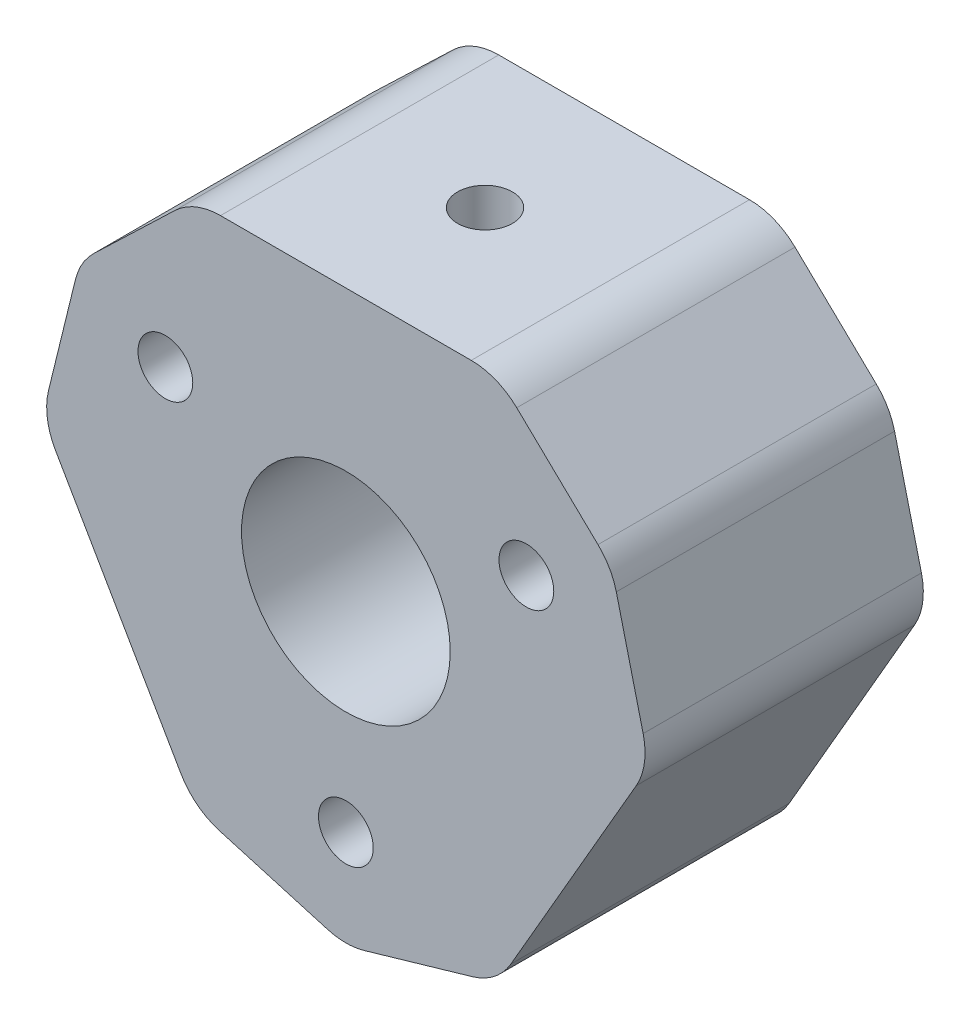
ISO-10303-21;
HEADER;
FILE_DESCRIPTION(('STEP AP214'),'2;1');
FILE_NAME('part.step','',(''),(''),'','','');
FILE_SCHEMA(('AUTOMOTIVE_DESIGN { 1 0 10303 214 1 1 1 1 }'));
ENDSEC;
DATA;
#1=APPLICATION_CONTEXT('core data for automotive mechanical design processes');
#2=APPLICATION_PROTOCOL_DEFINITION('international standard','automotive_design',2000,#1);
#3=PRODUCT_CONTEXT('',#1,'mechanical');
#4=PRODUCT('Part','Part','',(#3));
#5=PRODUCT_RELATED_PRODUCT_CATEGORY('part','',(#4));
#6=PRODUCT_DEFINITION_FORMATION('','',#4);
#7=PRODUCT_DEFINITION_CONTEXT('part definition',#1,'design');
#8=PRODUCT_DEFINITION('design','',#6,#7);
#9=PRODUCT_DEFINITION_SHAPE('','',#8);
#10=(LENGTH_UNIT() NAMED_UNIT(*) SI_UNIT(.MILLI.,.METRE.));
#11=(NAMED_UNIT(*) PLANE_ANGLE_UNIT() SI_UNIT($,.RADIAN.));
#12=(NAMED_UNIT(*) SI_UNIT($,.STERADIAN.) SOLID_ANGLE_UNIT());
#13=UNCERTAINTY_MEASURE_WITH_UNIT(LENGTH_MEASURE(1.E-05),#10,'distance_accuracy_value','');
#14=(GEOMETRIC_REPRESENTATION_CONTEXT(3) GLOBAL_UNCERTAINTY_ASSIGNED_CONTEXT((#13)) GLOBAL_UNIT_ASSIGNED_CONTEXT((#10,
#11,#12)) REPRESENTATION_CONTEXT('',''));
#15=CARTESIAN_POINT('',(0.,0.,0.));
#16=DIRECTION('',(0.,0.,1.));
#17=DIRECTION('',(1.,0.,0.));
#18=AXIS2_PLACEMENT_3D('',#15,#16,#17);
#19=CARTESIAN_POINT('',(0.,-10.888495471054,12.7));
#20=DIRECTION('',(0.,0.,1.));
#21=DIRECTION('',(1.,0.,0.));
#22=AXIS2_PLACEMENT_3D('',#19,#20,#21);
#23=PLANE('',#22);
#24=CARTESIAN_POINT('',(8.23806665349945,4.75625000000004,12.7));
#25=DIRECTION('',(0.,0.,1.));
#26=DIRECTION('',(1.,0.,0.));
#27=AXIS2_PLACEMENT_3D('',#24,#25,#26);
#28=CIRCLE('',#27,1.25);
#29=CARTESIAN_POINT('',(9.48806665349945,4.75625000000004,12.7));
#30=VERTEX_POINT('',#29);
#31=EDGE_CURVE('E394',#30,#30,#28,.T.);
#32=ORIENTED_EDGE('',*,*,#31,.F.);
#33=EDGE_LOOP('',(#32));
#34=FACE_BOUND('',#33,.T.);
#35=CARTESIAN_POINT('',(0.,0.,12.7));
#36=DIRECTION('',(0.,0.,1.));
#37=DIRECTION('',(1.,0.,0.));
#38=AXIS2_PLACEMENT_3D('',#35,#36,#37);
#39=CIRCLE('',#38,4.7625);
#40=CARTESIAN_POINT('',(4.7625,0.,12.7));
#41=VERTEX_POINT('',#40);
#42=EDGE_CURVE('E210',#41,#41,#39,.T.);
#43=ORIENTED_EDGE('',*,*,#42,.F.);
#44=EDGE_LOOP('',(#43));
#45=FACE_BOUND('',#44,.T.);
#46=CARTESIAN_POINT('',(0.,-10.888495471054,12.7));
#47=DIRECTION('',(0.,0.,1.));
#48=DIRECTION('',(1.,0.,0.));
#49=AXIS2_PLACEMENT_3D('',#46,#47,#48);
#50=CIRCLE('',#49,3.);
#51=CARTESIAN_POINT('',(-0.836847118322298,-13.7694131895173,12.7));
#52=VERTEX_POINT('',#51);
#53=CARTESIAN_POINT('',(0.836847118322313,-13.7694131895173,12.7));
#54=VERTEX_POINT('',#53);
#55=EDGE_CURVE('E241',#52,#54,#50,.T.);
#56=ORIENTED_EDGE('',*,*,#55,.T.);
#57=DIRECTION('',(0.960305906154426,0.278949039440768,0.));
#58=VECTOR('',#57,1.);
#59=CARTESIAN_POINT('',(0.836847118322313,-13.7694131895173,12.7));
#60=LINE('',#59,#58);
#61=CARTESIAN_POINT('',(5.77000843492431,-12.3364316761752,12.7));
#62=VERTEX_POINT('',#61);
#63=EDGE_CURVE('E139',#54,#62,#60,.T.);
#64=ORIENTED_EDGE('',*,*,#63,.T.);
#65=CARTESIAN_POINT('',(4.93316131660201,-9.45551395771196,12.7));
#66=DIRECTION('',(0.,0.,1.));
#67=DIRECTION('',(1.,0.,0.));
#68=AXIS2_PLACEMENT_3D('',#65,#66,#67);
#69=CIRCLE('',#68,3.);
#70=CARTESIAN_POINT('',(7.53123752795532,-10.955513957712,12.7));
#71=VERTEX_POINT('',#70);
#72=EDGE_CURVE('E286',#62,#71,#69,.T.);
#73=ORIENTED_EDGE('',*,*,#72,.T.);
#74=DIRECTION('',(0.499999999999999,0.866025403784439,0.));
#75=VECTOR('',#74,1.);
#76=CARTESIAN_POINT('',(7.53123752795532,-10.955513957712,12.7));
#77=LINE('',#76,#75);
#78=CARTESIAN_POINT('',(13.2533721628712,-1.04448604228802,12.7));
#79=VERTEX_POINT('',#78);
#80=EDGE_CURVE('E305',#71,#79,#77,.T.);
#81=ORIENTED_EDGE('',*,*,#80,.T.);
#82=CARTESIAN_POINT('',(10.6552959515179,0.455513957711976,12.7));
#83=DIRECTION('',(0.,0.,1.));
#84=DIRECTION('',(1.,0.,0.));
#85=AXIS2_PLACEMENT_3D('',#82,#83,#84);
#86=CIRCLE('',#85,3.);
#87=CARTESIAN_POINT('',(13.568667441081,1.17124195339269,12.7));
#88=VERTEX_POINT('',#87);
#89=EDGE_CURVE('E302',#79,#88,#86,.T.);
#90=ORIENTED_EDGE('',*,*,#89,.T.);
#91=DIRECTION('',(-0.238575998560237,0.971123829854353,0.));
#92=VECTOR('',#91,1.);
#93=CARTESIAN_POINT('',(12.3430851764877,6.15997573120774,12.7));
#94=LINE('',#93,#92);
#95=CARTESIAN_POINT('',(12.3430851764877,6.15997573120774,12.7));
#96=VERTEX_POINT('',#95);
#97=EDGE_CURVE('E304',#88,#96,#94,.T.);
#98=ORIENTED_EDGE('',*,*,#97,.T.);
#99=CARTESIAN_POINT('',(9.42971368692461,5.44424773552703,12.7));
#100=DIRECTION('',(0.,0.,1.));
#101=DIRECTION('',(-1.,0.,0.));
#102=AXIS2_PLACEMENT_3D('',#99,#100,#101);
#103=CIRCLE('',#102,3.);
#104=CARTESIAN_POINT('',(11.5062380581653,7.60943745830959,12.7));
#105=VERTEX_POINT('',#104);
#106=EDGE_CURVE('E307',#96,#105,#103,.T.);
#107=ORIENTED_EDGE('',*,*,#106,.T.);
#108=DIRECTION('',(-0.721729907594188,0.692174790413581,0.));
#109=VECTOR('',#108,1.);
#110=CARTESIAN_POINT('',(7.79865900615664,11.1651897227826,12.7));
#111=LINE('',#110,#109);
#112=CARTESIAN_POINT('',(7.79865900615664,11.1651897227826,12.7));
#113=VERTEX_POINT('',#112);
#114=EDGE_CURVE('E313',#105,#113,#111,.T.);
#115=ORIENTED_EDGE('',*,*,#114,.T.);
#116=CARTESIAN_POINT('',(5.7221346349159,9.,12.7));
#117=DIRECTION('',(0.,0.,1.));
#118=DIRECTION('',(1.,0.,0.));
#119=AXIS2_PLACEMENT_3D('',#116,#117,#118);
#120=CIRCLE('',#119,3.);
#121=CARTESIAN_POINT('',(5.7221346349159,12.,12.7));
#122=VERTEX_POINT('',#121);
#123=EDGE_CURVE('E315',#113,#122,#120,.T.);
#124=ORIENTED_EDGE('',*,*,#123,.T.);
#125=DIRECTION('',(-1.,0.,0.));
#126=VECTOR('',#125,1.);
#127=CARTESIAN_POINT('',(5.7221346349159,12.,12.7));
#128=LINE('',#127,#126);
#129=CARTESIAN_POINT('',(-5.7221346349159,12.,12.7));
#130=VERTEX_POINT('',#129);
#131=EDGE_CURVE('E317',#122,#130,#128,.T.);
#132=ORIENTED_EDGE('',*,*,#131,.T.);
#133=CARTESIAN_POINT('',(-5.7221346349159,9.,12.7));
#134=DIRECTION('',(0.,0.,1.));
#135=DIRECTION('',(1.,0.,0.));
#136=AXIS2_PLACEMENT_3D('',#133,#134,#135);
#137=CIRCLE('',#136,3.);
#138=CARTESIAN_POINT('',(-7.79865900615666,11.1651897227825,12.7));
#139=VERTEX_POINT('',#138);
#140=EDGE_CURVE('E319',#130,#139,#137,.T.);
#141=ORIENTED_EDGE('',*,*,#140,.T.);
#142=DIRECTION('',(-0.721729907594183,-0.692174790413586,0.));
#143=VECTOR('',#142,1.);
#144=CARTESIAN_POINT('',(-7.79865900615666,11.1651897227825,12.7));
#145=LINE('',#144,#143);
#146=CARTESIAN_POINT('',(-11.5062380581653,7.60943745830954,12.7));
#147=VERTEX_POINT('',#146);
#148=EDGE_CURVE('E321',#139,#147,#145,.T.);
#149=ORIENTED_EDGE('',*,*,#148,.T.);
#150=CARTESIAN_POINT('',(-9.42971368692457,5.44424773552699,12.7));
#151=DIRECTION('',(0.,0.,1.));
#152=DIRECTION('',(1.,0.,0.));
#153=AXIS2_PLACEMENT_3D('',#150,#151,#152);
#154=CIRCLE('',#153,3.);
#155=CARTESIAN_POINT('',(-12.3430851764876,6.15997573120772,12.7));
#156=VERTEX_POINT('',#155);
#157=EDGE_CURVE('E323',#147,#156,#154,.T.);
#158=ORIENTED_EDGE('',*,*,#157,.T.);
#159=DIRECTION('',(-0.238575998560243,-0.971123829854351,0.));
#160=VECTOR('',#159,1.);
#161=CARTESIAN_POINT('',(-12.3430851764876,6.15997573120772,12.7));
#162=LINE('',#161,#160);
#163=CARTESIAN_POINT('',(-13.5686674410809,1.17124195339268,12.7));
#164=VERTEX_POINT('',#163);
#165=EDGE_CURVE('E325',#156,#164,#162,.T.);
#166=ORIENTED_EDGE('',*,*,#165,.T.);
#167=CARTESIAN_POINT('',(-10.6552959515179,0.455513957711953,12.7));
#168=DIRECTION('',(0.,0.,1.));
#169=DIRECTION('',(-1.,0.,0.));
#170=AXIS2_PLACEMENT_3D('',#167,#168,#169);
#171=CIRCLE('',#170,3.);
#172=CARTESIAN_POINT('',(-13.2533721628712,-1.04448604228805,12.7));
#173=VERTEX_POINT('',#172);
#174=EDGE_CURVE('E188',#164,#173,#171,.T.);
#175=ORIENTED_EDGE('',*,*,#174,.T.);
#176=DIRECTION('',(0.5,-0.866025403784438,0.));
#177=VECTOR('',#176,1.);
#178=CARTESIAN_POINT('',(-13.2533721628712,-1.04448604228805,12.7));
#179=LINE('',#178,#177);
#180=CARTESIAN_POINT('',(-7.53123752795531,-10.955513957712,12.7));
#181=VERTEX_POINT('',#180);
#182=EDGE_CURVE('E182',#173,#181,#179,.T.);
#183=ORIENTED_EDGE('',*,*,#182,.T.);
#184=CARTESIAN_POINT('',(-4.93316131660199,-9.45551395771196,12.7));
#185=DIRECTION('',(0.,0.,1.));
#186=DIRECTION('',(1.,0.,0.));
#187=AXIS2_PLACEMENT_3D('',#184,#185,#186);
#188=CIRCLE('',#187,3.);
#189=CARTESIAN_POINT('',(-5.7700084349243,-12.3364316761752,12.7));
#190=VERTEX_POINT('',#189);
#191=EDGE_CURVE('E186',#181,#190,#188,.T.);
#192=ORIENTED_EDGE('',*,*,#191,.T.);
#193=DIRECTION('',(0.960305906154426,-0.278949039440768,0.));
#194=VECTOR('',#193,1.);
#195=CARTESIAN_POINT('',(-5.7700084349243,-12.3364316761752,12.7));
#196=LINE('',#195,#194);
#197=EDGE_CURVE('E66',#190,#52,#196,.T.);
#198=ORIENTED_EDGE('',*,*,#197,.T.);
#199=EDGE_LOOP('',(#56,#64,#73,#81,#90,#98,#107,#115,#124,#132,#141,#149,#158,#166,#175,#183,
#192,#198));
#200=FACE_BOUND('',#199,.T.);
#201=CARTESIAN_POINT('',(-8.23806665349949,4.75624999999998,12.7));
#202=DIRECTION('',(0.,0.,1.));
#203=DIRECTION('',(1.,0.,0.));
#204=AXIS2_PLACEMENT_3D('',#201,#202,#203);
#205=CIRCLE('',#204,1.25);
#206=CARTESIAN_POINT('',(-6.98806665349949,4.75624999999998,12.7));
#207=VERTEX_POINT('',#206);
#208=EDGE_CURVE('E400',#207,#207,#205,.T.);
#209=ORIENTED_EDGE('',*,*,#208,.F.);
#210=EDGE_LOOP('',(#209));
#211=FACE_BOUND('',#210,.T.);
#212=CARTESIAN_POINT('',(0.,-9.5125,12.7));
#213=DIRECTION('',(0.,0.,1.));
#214=DIRECTION('',(1.,0.,0.));
#215=AXIS2_PLACEMENT_3D('',#212,#213,#214);
#216=CIRCLE('',#215,1.25);
#217=CARTESIAN_POINT('',(1.25,-9.5125,12.7));
#218=VERTEX_POINT('',#217);
#219=EDGE_CURVE('E388',#218,#218,#216,.T.);
#220=ORIENTED_EDGE('',*,*,#219,.F.);
#221=EDGE_LOOP('',(#220));
#222=FACE_BOUND('',#221,.T.);
#223=ADVANCED_FACE('F49',(#34,#45,#200,#211,#222),#23,.T.);
#224=CARTESIAN_POINT('',(0.,-10.888495471054,0.));
#225=DIRECTION('',(0.,0.,1.));
#226=DIRECTION('',(1.,0.,0.));
#227=AXIS2_PLACEMENT_3D('',#224,#225,#226);
#228=PLANE('',#227);
#229=CARTESIAN_POINT('',(0.,-10.888495471054,0.));
#230=DIRECTION('',(0.,0.,1.));
#231=DIRECTION('',(1.,0.,0.));
#232=AXIS2_PLACEMENT_3D('',#229,#230,#231);
#233=CIRCLE('',#232,3.);
#234=CARTESIAN_POINT('',(-0.836847118322298,-13.7694131895173,0.));
#235=VERTEX_POINT('',#234);
#236=CARTESIAN_POINT('',(0.836847118322313,-13.7694131895173,0.));
#237=VERTEX_POINT('',#236);
#238=EDGE_CURVE('E206',#235,#237,#233,.T.);
#239=ORIENTED_EDGE('',*,*,#238,.F.);
#240=DIRECTION('',(0.960305906154426,-0.278949039440768,0.));
#241=VECTOR('',#240,1.);
#242=CARTESIAN_POINT('',(-5.7700084349243,-12.3364316761752,0.));
#243=LINE('',#242,#241);
#244=CARTESIAN_POINT('',(-5.7700084349243,-12.3364316761752,0.));
#245=VERTEX_POINT('',#244);
#246=EDGE_CURVE('E131',#245,#235,#243,.T.);
#247=ORIENTED_EDGE('',*,*,#246,.F.);
#248=CARTESIAN_POINT('',(-4.93316131660199,-9.45551395771196,0.));
#249=DIRECTION('',(0.,0.,1.));
#250=DIRECTION('',(1.,0.,0.));
#251=AXIS2_PLACEMENT_3D('',#248,#249,#250);
#252=CIRCLE('',#251,3.);
#253=CARTESIAN_POINT('',(-7.53123752795531,-10.955513957712,0.));
#254=VERTEX_POINT('',#253);
#255=EDGE_CURVE('E125',#254,#245,#252,.T.);
#256=ORIENTED_EDGE('',*,*,#255,.F.);
#257=DIRECTION('',(0.5,-0.866025403784438,0.));
#258=VECTOR('',#257,1.);
#259=CARTESIAN_POINT('',(-13.2533721628712,-1.04448604228805,0.));
#260=LINE('',#259,#258);
#261=CARTESIAN_POINT('',(-13.2533721628712,-1.04448604228805,0.));
#262=VERTEX_POINT('',#261);
#263=EDGE_CURVE('E196',#262,#254,#260,.T.);
#264=ORIENTED_EDGE('',*,*,#263,.F.);
#265=CARTESIAN_POINT('',(-10.6552959515179,0.455513957711953,0.));
#266=DIRECTION('',(0.,0.,1.));
#267=DIRECTION('',(-1.,0.,0.));
#268=AXIS2_PLACEMENT_3D('',#265,#266,#267);
#269=CIRCLE('',#268,3.);
#270=CARTESIAN_POINT('',(-13.5686674410809,1.17124195339268,0.));
#271=VERTEX_POINT('',#270);
#272=EDGE_CURVE('E236',#271,#262,#269,.T.);
#273=ORIENTED_EDGE('',*,*,#272,.F.);
#274=DIRECTION('',(-0.238575998560243,-0.971123829854351,0.));
#275=VECTOR('',#274,1.);
#276=CARTESIAN_POINT('',(-12.3430851764876,6.15997573120772,0.));
#277=LINE('',#276,#275);
#278=CARTESIAN_POINT('',(-12.3430851764876,6.15997573120772,0.));
#279=VERTEX_POINT('',#278);
#280=EDGE_CURVE('E234',#279,#271,#277,.T.);
#281=ORIENTED_EDGE('',*,*,#280,.F.);
#282=CARTESIAN_POINT('',(-9.42971368692457,5.44424773552699,0.));
#283=DIRECTION('',(0.,0.,1.));
#284=DIRECTION('',(1.,0.,0.));
#285=AXIS2_PLACEMENT_3D('',#282,#283,#284);
#286=CIRCLE('',#285,3.);
#287=CARTESIAN_POINT('',(-11.5062380581653,7.60943745830954,0.));
#288=VERTEX_POINT('',#287);
#289=EDGE_CURVE('E232',#288,#279,#286,.T.);
#290=ORIENTED_EDGE('',*,*,#289,.F.);
#291=DIRECTION('',(-0.721729907594183,-0.692174790413586,0.));
#292=VECTOR('',#291,1.);
#293=CARTESIAN_POINT('',(-7.79865900615666,11.1651897227825,0.));
#294=LINE('',#293,#292);
#295=CARTESIAN_POINT('',(-7.79865900615666,11.1651897227825,0.));
#296=VERTEX_POINT('',#295);
#297=EDGE_CURVE('E230',#296,#288,#294,.T.);
#298=ORIENTED_EDGE('',*,*,#297,.F.);
#299=CARTESIAN_POINT('',(-5.7221346349159,9.,0.));
#300=DIRECTION('',(0.,0.,1.));
#301=DIRECTION('',(1.,0.,0.));
#302=AXIS2_PLACEMENT_3D('',#299,#300,#301);
#303=CIRCLE('',#302,3.);
#304=CARTESIAN_POINT('',(-5.7221346349159,12.,0.));
#305=VERTEX_POINT('',#304);
#306=EDGE_CURVE('E228',#305,#296,#303,.T.);
#307=ORIENTED_EDGE('',*,*,#306,.F.);
#308=DIRECTION('',(-1.,0.,0.));
#309=VECTOR('',#308,1.);
#310=CARTESIAN_POINT('',(5.7221346349159,12.,0.));
#311=LINE('',#310,#309);
#312=CARTESIAN_POINT('',(5.7221346349159,12.,0.));
#313=VERTEX_POINT('',#312);
#314=EDGE_CURVE('E226',#313,#305,#311,.T.);
#315=ORIENTED_EDGE('',*,*,#314,.F.);
#316=CARTESIAN_POINT('',(5.7221346349159,9.,0.));
#317=DIRECTION('',(0.,0.,1.));
#318=DIRECTION('',(1.,0.,0.));
#319=AXIS2_PLACEMENT_3D('',#316,#317,#318);
#320=CIRCLE('',#319,3.);
#321=CARTESIAN_POINT('',(7.79865900615664,11.1651897227826,0.));
#322=VERTEX_POINT('',#321);
#323=EDGE_CURVE('E224',#322,#313,#320,.T.);
#324=ORIENTED_EDGE('',*,*,#323,.F.);
#325=DIRECTION('',(-0.721729907594188,0.692174790413581,0.));
#326=VECTOR('',#325,1.);
#327=CARTESIAN_POINT('',(7.79865900615664,11.1651897227826,0.));
#328=LINE('',#327,#326);
#329=CARTESIAN_POINT('',(11.5062380581653,7.60943745830959,0.));
#330=VERTEX_POINT('',#329);
#331=EDGE_CURVE('E222',#330,#322,#328,.T.);
#332=ORIENTED_EDGE('',*,*,#331,.F.);
#333=CARTESIAN_POINT('',(9.42971368692461,5.44424773552703,0.));
#334=DIRECTION('',(0.,0.,1.));
#335=DIRECTION('',(-1.,0.,0.));
#336=AXIS2_PLACEMENT_3D('',#333,#334,#335);
#337=CIRCLE('',#336,3.);
#338=CARTESIAN_POINT('',(12.3430851764877,6.15997573120774,0.));
#339=VERTEX_POINT('',#338);
#340=EDGE_CURVE('E220',#339,#330,#337,.T.);
#341=ORIENTED_EDGE('',*,*,#340,.F.);
#342=DIRECTION('',(-0.238575998560237,0.971123829854353,0.));
#343=VECTOR('',#342,1.);
#344=CARTESIAN_POINT('',(12.3430851764877,6.15997573120774,0.));
#345=LINE('',#344,#343);
#346=CARTESIAN_POINT('',(13.568667441081,1.17124195339269,0.));
#347=VERTEX_POINT('',#346);
#348=EDGE_CURVE('E218',#347,#339,#345,.T.);
#349=ORIENTED_EDGE('',*,*,#348,.F.);
#350=CARTESIAN_POINT('',(10.6552959515179,0.455513957711976,0.));
#351=DIRECTION('',(0.,0.,1.));
#352=DIRECTION('',(1.,0.,0.));
#353=AXIS2_PLACEMENT_3D('',#350,#351,#352);
#354=CIRCLE('',#353,3.);
#355=CARTESIAN_POINT('',(13.2533721628712,-1.04448604228802,0.));
#356=VERTEX_POINT('',#355);
#357=EDGE_CURVE('E216',#356,#347,#354,.T.);
#358=ORIENTED_EDGE('',*,*,#357,.F.);
#359=DIRECTION('',(0.499999999999999,0.866025403784439,0.));
#360=VECTOR('',#359,1.);
#361=CARTESIAN_POINT('',(7.53123752795532,-10.955513957712,0.));
#362=LINE('',#361,#360);
#363=CARTESIAN_POINT('',(7.53123752795532,-10.955513957712,0.));
#364=VERTEX_POINT('',#363);
#365=EDGE_CURVE('E214',#364,#356,#362,.T.);
#366=ORIENTED_EDGE('',*,*,#365,.F.);
#367=CARTESIAN_POINT('',(4.93316131660201,-9.45551395771196,0.));
#368=DIRECTION('',(0.,0.,1.));
#369=DIRECTION('',(1.,0.,0.));
#370=AXIS2_PLACEMENT_3D('',#367,#368,#369);
#371=CIRCLE('',#370,3.);
#372=CARTESIAN_POINT('',(5.77000843492431,-12.3364316761752,0.));
#373=VERTEX_POINT('',#372);
#374=EDGE_CURVE('E212',#373,#364,#371,.T.);
#375=ORIENTED_EDGE('',*,*,#374,.F.);
#376=DIRECTION('',(0.960305906154426,0.278949039440768,0.));
#377=VECTOR('',#376,1.);
#378=CARTESIAN_POINT('',(0.836847118322313,-13.7694131895173,0.));
#379=LINE('',#378,#377);
#380=EDGE_CURVE('E209',#237,#373,#379,.T.);
#381=ORIENTED_EDGE('',*,*,#380,.F.);
#382=EDGE_LOOP('',(#239,#247,#256,#264,#273,#281,#290,#298,#307,#315,#324,#332,#341,#349,#358,
#366,#375,#381));
#383=FACE_BOUND('',#382,.T.);
#384=CARTESIAN_POINT('',(0.,0.,0.));
#385=DIRECTION('',(0.,0.,1.));
#386=DIRECTION('',(1.,0.,0.));
#387=AXIS2_PLACEMENT_3D('',#384,#385,#386);
#388=CIRCLE('',#387,4.7625);
#389=CARTESIAN_POINT('',(4.7625,0.,0.));
#390=VERTEX_POINT('',#389);
#391=EDGE_CURVE('E403',#390,#390,#388,.T.);
#392=ORIENTED_EDGE('',*,*,#391,.T.);
#393=EDGE_LOOP('',(#392));
#394=FACE_BOUND('',#393,.T.);
#395=CARTESIAN_POINT('',(-8.23806665349949,4.75624999999998,0.));
#396=DIRECTION('',(0.,0.,1.));
#397=DIRECTION('',(1.,0.,0.));
#398=AXIS2_PLACEMENT_3D('',#395,#396,#397);
#399=CIRCLE('',#398,1.25);
#400=CARTESIAN_POINT('',(-6.98806665349949,4.75624999999998,0.));
#401=VERTEX_POINT('',#400);
#402=EDGE_CURVE('E397',#401,#401,#399,.T.);
#403=ORIENTED_EDGE('',*,*,#402,.T.);
#404=EDGE_LOOP('',(#403));
#405=FACE_BOUND('',#404,.T.);
#406=CARTESIAN_POINT('',(8.23806665349945,4.75625000000004,0.));
#407=DIRECTION('',(0.,0.,1.));
#408=DIRECTION('',(1.,0.,0.));
#409=AXIS2_PLACEMENT_3D('',#406,#407,#408);
#410=CIRCLE('',#409,1.25);
#411=CARTESIAN_POINT('',(9.48806665349945,4.75625000000004,0.));
#412=VERTEX_POINT('',#411);
#413=EDGE_CURVE('E391',#412,#412,#410,.T.);
#414=ORIENTED_EDGE('',*,*,#413,.T.);
#415=EDGE_LOOP('',(#414));
#416=FACE_BOUND('',#415,.T.);
#417=CARTESIAN_POINT('',(0.,-9.5125,0.));
#418=DIRECTION('',(0.,0.,1.));
#419=DIRECTION('',(1.,0.,0.));
#420=AXIS2_PLACEMENT_3D('',#417,#418,#419);
#421=CIRCLE('',#420,1.25);
#422=CARTESIAN_POINT('',(1.25,-9.5125,0.));
#423=VERTEX_POINT('',#422);
#424=EDGE_CURVE('E386',#423,#423,#421,.T.);
#425=ORIENTED_EDGE('',*,*,#424,.T.);
#426=EDGE_LOOP('',(#425));
#427=FACE_BOUND('',#426,.T.);
#428=ADVANCED_FACE('F290',(#383,#394,#405,#416,#427),#228,.F.);
#429=CARTESIAN_POINT('',(0.,-10.888495471054,12.7));
#430=DIRECTION('',(0.,0.,-1.));
#431=DIRECTION('',(-1.,0.,0.));
#432=AXIS2_PLACEMENT_3D('',#429,#430,#431);
#433=CYLINDRICAL_SURFACE('',#432,3.);
#434=ORIENTED_EDGE('',*,*,#238,.T.);
#435=DIRECTION('',(0.,0.,-1.));
#436=VECTOR('',#435,1.);
#437=CARTESIAN_POINT('',(0.836847118322313,-13.7694131895173,12.7));
#438=LINE('',#437,#436);
#439=EDGE_CURVE('E12',#54,#237,#438,.T.);
#440=ORIENTED_EDGE('',*,*,#439,.F.);
#441=ORIENTED_EDGE('',*,*,#55,.F.);
#442=DIRECTION('',(0.,0.,-1.));
#443=VECTOR('',#442,1.);
#444=CARTESIAN_POINT('',(-0.836847118322298,-13.7694131895173,12.7));
#445=LINE('',#444,#443);
#446=EDGE_CURVE('E202',#52,#235,#445,.T.);
#447=ORIENTED_EDGE('',*,*,#446,.T.);
#448=EDGE_LOOP('',(#434,#440,#441,#447));
#449=FACE_BOUND('',#448,.T.);
#450=ADVANCED_FACE('F51',(#449),#433,.T.);
#451=CARTESIAN_POINT('',(0.836847118322313,-13.7694131895173,12.7));
#452=DIRECTION('',(-0.278949039440768,0.960305906154426,0.));
#453=DIRECTION('',(-0.960305906154426,-0.278949039440768,0.));
#454=AXIS2_PLACEMENT_3D('',#451,#452,#453);
#455=PLANE('',#454);
#456=ORIENTED_EDGE('',*,*,#380,.T.);
#457=DIRECTION('',(0.,0.,-1.));
#458=VECTOR('',#457,1.);
#459=CARTESIAN_POINT('',(5.77000843492431,-12.3364316761752,12.7));
#460=LINE('',#459,#458);
#461=EDGE_CURVE('E58',#62,#373,#460,.T.);
#462=ORIENTED_EDGE('',*,*,#461,.F.);
#463=ORIENTED_EDGE('',*,*,#63,.F.);
#464=ORIENTED_EDGE('',*,*,#439,.T.);
#465=EDGE_LOOP('',(#456,#462,#463,#464));
#466=FACE_BOUND('',#465,.T.);
#467=ADVANCED_FACE('F486',(#466),#455,.F.);
#468=CARTESIAN_POINT('',(4.93316131660201,-9.45551395771196,12.7));
#469=DIRECTION('',(0.,0.,-1.));
#470=DIRECTION('',(-1.,0.,0.));
#471=AXIS2_PLACEMENT_3D('',#468,#469,#470);
#472=CYLINDRICAL_SURFACE('',#471,3.);
#473=ORIENTED_EDGE('',*,*,#374,.T.);
#474=DIRECTION('',(0.,0.,-1.));
#475=VECTOR('',#474,1.);
#476=CARTESIAN_POINT('',(7.53123752795532,-10.955513957712,12.7));
#477=LINE('',#476,#475);
#478=EDGE_CURVE('E278',#71,#364,#477,.T.);
#479=ORIENTED_EDGE('',*,*,#478,.F.);
#480=ORIENTED_EDGE('',*,*,#72,.F.);
#481=ORIENTED_EDGE('',*,*,#461,.T.);
#482=EDGE_LOOP('',(#473,#479,#480,#481));
#483=FACE_BOUND('',#482,.T.);
#484=ADVANCED_FACE('F284',(#483),#472,.T.);
#485=CARTESIAN_POINT('',(7.53123752795532,-10.955513957712,12.7));
#486=DIRECTION('',(-0.866025403784439,0.499999999999999,0.));
#487=DIRECTION('',(-0.499999999999999,-0.866025403784439,0.));
#488=AXIS2_PLACEMENT_3D('',#485,#486,#487);
#489=PLANE('',#488);
#490=ORIENTED_EDGE('',*,*,#365,.T.);
#491=DIRECTION('',(0.,0.,-1.));
#492=VECTOR('',#491,1.);
#493=CARTESIAN_POINT('',(13.2533721628712,-1.04448604228802,12.7));
#494=LINE('',#493,#492);
#495=EDGE_CURVE('E275',#79,#356,#494,.T.);
#496=ORIENTED_EDGE('',*,*,#495,.F.);
#497=ORIENTED_EDGE('',*,*,#80,.F.);
#498=ORIENTED_EDGE('',*,*,#478,.T.);
#499=EDGE_LOOP('',(#490,#496,#497,#498));
#500=FACE_BOUND('',#499,.T.);
#501=ADVANCED_FACE('F296',(#500),#489,.F.);
#502=CARTESIAN_POINT('',(10.6552959515179,0.455513957711976,12.7));
#503=DIRECTION('',(0.,0.,-1.));
#504=DIRECTION('',(-1.,0.,0.));
#505=AXIS2_PLACEMENT_3D('',#502,#503,#504);
#506=CYLINDRICAL_SURFACE('',#505,3.);
#507=ORIENTED_EDGE('',*,*,#357,.T.);
#508=DIRECTION('',(0.,0.,-1.));
#509=VECTOR('',#508,1.);
#510=CARTESIAN_POINT('',(13.568667441081,1.17124195339269,12.7));
#511=LINE('',#510,#509);
#512=EDGE_CURVE('E272',#88,#347,#511,.T.);
#513=ORIENTED_EDGE('',*,*,#512,.F.);
#514=ORIENTED_EDGE('',*,*,#89,.F.);
#515=ORIENTED_EDGE('',*,*,#495,.T.);
#516=EDGE_LOOP('',(#507,#513,#514,#515));
#517=FACE_BOUND('',#516,.T.);
#518=ADVANCED_FACE('F300',(#517),#506,.T.);
#519=CARTESIAN_POINT('',(12.3430851764877,6.15997573120774,12.7));
#520=DIRECTION('',(-0.971123829854353,-0.238575998560237,0.));
#521=DIRECTION('',(0.238575998560237,-0.971123829854353,0.));
#522=AXIS2_PLACEMENT_3D('',#519,#520,#521);
#523=PLANE('',#522);
#524=ORIENTED_EDGE('',*,*,#348,.T.);
#525=DIRECTION('',(0.,0.,-1.));
#526=VECTOR('',#525,1.);
#527=CARTESIAN_POINT('',(12.3430851764877,6.15997573120774,12.7));
#528=LINE('',#527,#526);
#529=EDGE_CURVE('E269',#96,#339,#528,.T.);
#530=ORIENTED_EDGE('',*,*,#529,.F.);
#531=ORIENTED_EDGE('',*,*,#97,.F.);
#532=ORIENTED_EDGE('',*,*,#512,.T.);
#533=EDGE_LOOP('',(#524,#530,#531,#532));
#534=FACE_BOUND('',#533,.T.);
#535=ADVANCED_FACE('F476',(#534),#523,.F.);
#536=CARTESIAN_POINT('',(9.42971368692461,5.44424773552703,12.7));
#537=DIRECTION('',(0.,0.,-1.));
#538=DIRECTION('',(-1.,0.,0.));
#539=AXIS2_PLACEMENT_3D('',#536,#537,#538);
#540=CYLINDRICAL_SURFACE('',#539,3.);
#541=ORIENTED_EDGE('',*,*,#340,.T.);
#542=DIRECTION('',(0.,0.,-1.));
#543=VECTOR('',#542,1.);
#544=CARTESIAN_POINT('',(11.5062380581653,7.60943745830959,12.7));
#545=LINE('',#544,#543);
#546=EDGE_CURVE('E266',#105,#330,#545,.T.);
#547=ORIENTED_EDGE('',*,*,#546,.F.);
#548=ORIENTED_EDGE('',*,*,#106,.F.);
#549=ORIENTED_EDGE('',*,*,#529,.T.);
#550=EDGE_LOOP('',(#541,#547,#548,#549));
#551=FACE_BOUND('',#550,.T.);
#552=ADVANCED_FACE('F472',(#551),#540,.T.);
#553=CARTESIAN_POINT('',(7.79865900615664,11.1651897227826,12.7));
#554=DIRECTION('',(-0.692174790413581,-0.721729907594188,0.));
#555=DIRECTION('',(0.721729907594188,-0.692174790413581,0.));
#556=AXIS2_PLACEMENT_3D('',#553,#554,#555);
#557=PLANE('',#556);
#558=ORIENTED_EDGE('',*,*,#331,.T.);
#559=DIRECTION('',(0.,0.,-1.));
#560=VECTOR('',#559,1.);
#561=CARTESIAN_POINT('',(7.79865900615664,11.1651897227826,12.7));
#562=LINE('',#561,#560);
#563=EDGE_CURVE('E263',#113,#322,#562,.T.);
#564=ORIENTED_EDGE('',*,*,#563,.F.);
#565=ORIENTED_EDGE('',*,*,#114,.F.);
#566=ORIENTED_EDGE('',*,*,#546,.T.);
#567=EDGE_LOOP('',(#558,#564,#565,#566));
#568=FACE_BOUND('',#567,.T.);
#569=ADVANCED_FACE('F468',(#568),#557,.F.);
#570=CARTESIAN_POINT('',(5.7221346349159,9.,12.7));
#571=DIRECTION('',(0.,0.,-1.));
#572=DIRECTION('',(-1.,0.,0.));
#573=AXIS2_PLACEMENT_3D('',#570,#571,#572);
#574=CYLINDRICAL_SURFACE('',#573,3.);
#575=ORIENTED_EDGE('',*,*,#323,.T.);
#576=DIRECTION('',(0.,0.,-1.));
#577=VECTOR('',#576,1.);
#578=CARTESIAN_POINT('',(5.7221346349159,12.,12.7));
#579=LINE('',#578,#577);
#580=EDGE_CURVE('E260',#122,#313,#579,.T.);
#581=ORIENTED_EDGE('',*,*,#580,.F.);
#582=ORIENTED_EDGE('',*,*,#123,.F.);
#583=ORIENTED_EDGE('',*,*,#563,.T.);
#584=EDGE_LOOP('',(#575,#581,#582,#583));
#585=FACE_BOUND('',#584,.T.);
#586=ADVANCED_FACE('F435',(#585),#574,.T.);
#587=CARTESIAN_POINT('',(5.7221346349159,12.,12.7));
#588=DIRECTION('',(0.,-1.,0.));
#589=DIRECTION('',(1.,0.,0.));
#590=AXIS2_PLACEMENT_3D('',#587,#588,#589);
#591=PLANE('',#590);
#592=CARTESIAN_POINT('',(0.,12.,6.35));
#593=DIRECTION('',(0.,1.,0.));
#594=DIRECTION('',(-1.,0.,0.));
#595=AXIS2_PLACEMENT_3D('',#592,#593,#594);
#596=CIRCLE('',#595,1.25);
#597=CARTESIAN_POINT('',(-1.25,12.,6.35));
#598=VERTEX_POINT('',#597);
#599=EDGE_CURVE('E387',#598,#598,#596,.T.);
#600=ORIENTED_EDGE('',*,*,#599,.F.);
#601=EDGE_LOOP('',(#600));
#602=FACE_BOUND('',#601,.T.);
#603=ORIENTED_EDGE('',*,*,#314,.T.);
#604=DIRECTION('',(0.,0.,-1.));
#605=VECTOR('',#604,1.);
#606=CARTESIAN_POINT('',(-5.7221346349159,12.,12.7));
#607=LINE('',#606,#605);
#608=EDGE_CURVE('E257',#130,#305,#607,.T.);
#609=ORIENTED_EDGE('',*,*,#608,.F.);
#610=ORIENTED_EDGE('',*,*,#131,.F.);
#611=ORIENTED_EDGE('',*,*,#580,.T.);
#612=EDGE_LOOP('',(#603,#609,#610,#611));
#613=FACE_BOUND('',#612,.T.);
#614=ADVANCED_FACE('F431',(#602,#613),#591,.F.);
#615=CARTESIAN_POINT('',(-5.7221346349159,9.,12.7));
#616=DIRECTION('',(0.,0.,-1.));
#617=DIRECTION('',(-1.,0.,0.));
#618=AXIS2_PLACEMENT_3D('',#615,#616,#617);
#619=CYLINDRICAL_SURFACE('',#618,3.);
#620=ORIENTED_EDGE('',*,*,#306,.T.);
#621=DIRECTION('',(0.,0.,-1.));
#622=VECTOR('',#621,1.);
#623=CARTESIAN_POINT('',(-7.79865900615666,11.1651897227825,12.7));
#624=LINE('',#623,#622);
#625=EDGE_CURVE('E254',#139,#296,#624,.T.);
#626=ORIENTED_EDGE('',*,*,#625,.F.);
#627=ORIENTED_EDGE('',*,*,#140,.F.);
#628=ORIENTED_EDGE('',*,*,#608,.T.);
#629=EDGE_LOOP('',(#620,#626,#627,#628));
#630=FACE_BOUND('',#629,.T.);
#631=ADVANCED_FACE('F434',(#630),#619,.T.);
#632=CARTESIAN_POINT('',(-7.79865900615666,11.1651897227825,12.7));
#633=DIRECTION('',(0.692174790413586,-0.721729907594183,0.));
#634=DIRECTION('',(0.721729907594183,0.692174790413586,0.));
#635=AXIS2_PLACEMENT_3D('',#632,#633,#634);
#636=PLANE('',#635);
#637=ORIENTED_EDGE('',*,*,#297,.T.);
#638=DIRECTION('',(0.,0.,-1.));
#639=VECTOR('',#638,1.);
#640=CARTESIAN_POINT('',(-11.5062380581653,7.60943745830954,12.7));
#641=LINE('',#640,#639);
#642=EDGE_CURVE('E251',#147,#288,#641,.T.);
#643=ORIENTED_EDGE('',*,*,#642,.F.);
#644=ORIENTED_EDGE('',*,*,#148,.F.);
#645=ORIENTED_EDGE('',*,*,#625,.T.);
#646=EDGE_LOOP('',(#637,#643,#644,#645));
#647=FACE_BOUND('',#646,.T.);
#648=ADVANCED_FACE('F450',(#647),#636,.F.);
#649=CARTESIAN_POINT('',(-9.42971368692457,5.44424773552699,12.7));
#650=DIRECTION('',(0.,0.,-1.));
#651=DIRECTION('',(-1.,0.,0.));
#652=AXIS2_PLACEMENT_3D('',#649,#650,#651);
#653=CYLINDRICAL_SURFACE('',#652,3.);
#654=ORIENTED_EDGE('',*,*,#289,.T.);
#655=DIRECTION('',(0.,0.,-1.));
#656=VECTOR('',#655,1.);
#657=CARTESIAN_POINT('',(-12.3430851764876,6.15997573120772,12.7));
#658=LINE('',#657,#656);
#659=EDGE_CURVE('E248',#156,#279,#658,.T.);
#660=ORIENTED_EDGE('',*,*,#659,.F.);
#661=ORIENTED_EDGE('',*,*,#157,.F.);
#662=ORIENTED_EDGE('',*,*,#642,.T.);
#663=EDGE_LOOP('',(#654,#660,#661,#662));
#664=FACE_BOUND('',#663,.T.);
#665=ADVANCED_FACE('F453',(#664),#653,.T.);
#666=CARTESIAN_POINT('',(-12.3430851764876,6.15997573120772,12.7));
#667=DIRECTION('',(0.971123829854351,-0.238575998560242,0.));
#668=DIRECTION('',(0.238575998560243,0.971123829854352,0.));
#669=AXIS2_PLACEMENT_3D('',#666,#667,#668);
#670=PLANE('',#669);
#671=ORIENTED_EDGE('',*,*,#280,.T.);
#672=DIRECTION('',(0.,0.,-1.));
#673=VECTOR('',#672,1.);
#674=CARTESIAN_POINT('',(-13.5686674410809,1.17124195339268,12.7));
#675=LINE('',#674,#673);
#676=EDGE_CURVE('E245',#164,#271,#675,.T.);
#677=ORIENTED_EDGE('',*,*,#676,.F.);
#678=ORIENTED_EDGE('',*,*,#165,.F.);
#679=ORIENTED_EDGE('',*,*,#659,.T.);
#680=EDGE_LOOP('',(#671,#677,#678,#679));
#681=FACE_BOUND('',#680,.T.);
#682=ADVANCED_FACE('F331',(#681),#670,.F.);
#683=CARTESIAN_POINT('',(-10.6552959515179,0.455513957711953,12.7));
#684=DIRECTION('',(0.,0.,-1.));
#685=DIRECTION('',(-1.,0.,0.));
#686=AXIS2_PLACEMENT_3D('',#683,#684,#685);
#687=CYLINDRICAL_SURFACE('',#686,3.);
#688=ORIENTED_EDGE('',*,*,#272,.T.);
#689=DIRECTION('',(0.,0.,-1.));
#690=VECTOR('',#689,1.);
#691=CARTESIAN_POINT('',(-13.2533721628712,-1.04448604228805,12.7));
#692=LINE('',#691,#690);
#693=EDGE_CURVE('E197',#173,#262,#692,.T.);
#694=ORIENTED_EDGE('',*,*,#693,.F.);
#695=ORIENTED_EDGE('',*,*,#174,.F.);
#696=ORIENTED_EDGE('',*,*,#676,.T.);
#697=EDGE_LOOP('',(#688,#694,#695,#696));
#698=FACE_BOUND('',#697,.T.);
#699=ADVANCED_FACE('F335',(#698),#687,.T.);
#700=CARTESIAN_POINT('',(-13.2533721628712,-1.04448604228805,12.7));
#701=DIRECTION('',(0.866025403784438,0.5,0.));
#702=DIRECTION('',(-0.500000000000001,0.866025403784438,0.));
#703=AXIS2_PLACEMENT_3D('',#700,#701,#702);
#704=PLANE('',#703);
#705=ORIENTED_EDGE('',*,*,#263,.T.);
#706=DIRECTION('',(0.,0.,-1.));
#707=VECTOR('',#706,1.);
#708=CARTESIAN_POINT('',(-7.53123752795531,-10.955513957712,12.7));
#709=LINE('',#708,#707);
#710=EDGE_CURVE('E193',#181,#254,#709,.T.);
#711=ORIENTED_EDGE('',*,*,#710,.F.);
#712=ORIENTED_EDGE('',*,*,#182,.F.);
#713=ORIENTED_EDGE('',*,*,#693,.T.);
#714=EDGE_LOOP('',(#705,#711,#712,#713));
#715=FACE_BOUND('',#714,.T.);
#716=ADVANCED_FACE('F194',(#715),#704,.F.);
#717=CARTESIAN_POINT('',(-4.93316131660199,-9.45551395771196,12.7));
#718=DIRECTION('',(0.,0.,-1.));
#719=DIRECTION('',(-1.,0.,0.));
#720=AXIS2_PLACEMENT_3D('',#717,#718,#719);
#721=CYLINDRICAL_SURFACE('',#720,3.);
#722=ORIENTED_EDGE('',*,*,#255,.T.);
#723=DIRECTION('',(0.,0.,-1.));
#724=VECTOR('',#723,1.);
#725=CARTESIAN_POINT('',(-5.7700084349243,-12.3364316761752,12.7));
#726=LINE('',#725,#724);
#727=EDGE_CURVE('E198',#190,#245,#726,.T.);
#728=ORIENTED_EDGE('',*,*,#727,.F.);
#729=ORIENTED_EDGE('',*,*,#191,.F.);
#730=ORIENTED_EDGE('',*,*,#710,.T.);
#731=EDGE_LOOP('',(#722,#728,#729,#730));
#732=FACE_BOUND('',#731,.T.);
#733=ADVANCED_FACE('F200',(#732),#721,.T.);
#734=CARTESIAN_POINT('',(-5.7700084349243,-12.3364316761752,12.7));
#735=DIRECTION('',(0.278949039440768,0.960305906154426,0.));
#736=DIRECTION('',(-0.960305906154426,0.278949039440768,0.));
#737=AXIS2_PLACEMENT_3D('',#734,#735,#736);
#738=PLANE('',#737);
#739=ORIENTED_EDGE('',*,*,#246,.T.);
#740=ORIENTED_EDGE('',*,*,#446,.F.);
#741=ORIENTED_EDGE('',*,*,#197,.F.);
#742=ORIENTED_EDGE('',*,*,#727,.T.);
#743=EDGE_LOOP('',(#739,#740,#741,#742));
#744=FACE_BOUND('',#743,.T.);
#745=ADVANCED_FACE('F339',(#744),#738,.F.);
#746=CARTESIAN_POINT('',(0.,0.,12.7));
#747=DIRECTION('',(0.,0.,-1.));
#748=DIRECTION('',(-1.,0.,0.));
#749=AXIS2_PLACEMENT_3D('',#746,#747,#748);
#750=CYLINDRICAL_SURFACE('',#749,4.7625);
#751=CARTESIAN_POINT('',(-1.25,4.5955311172921,6.35));
#752=CARTESIAN_POINT('',(-1.24999825815101,4.59553234834705,6.41890269033251));
#753=CARTESIAN_POINT('',(-1.24428349455561,4.59709768262114,6.48782402468803));
#754=CARTESIAN_POINT('',(-1.22161697987754,4.60317187024226,6.62367914039281));
#755=CARTESIAN_POINT('',(-1.20465936068669,4.60768226071646,6.69061186473366));
#756=CARTESIAN_POINT('',(-1.1601005907601,4.61910132751945,6.82050488405063));
#757=CARTESIAN_POINT('',(-1.13251408839263,4.62600670186044,6.88347050799917));
#758=CARTESIAN_POINT('',(-1.06752620292779,4.64143349037613,7.00388904867923));
#759=CARTESIAN_POINT('',(-1.03012414527324,4.64995501560687,7.06134158616261));
#760=CARTESIAN_POINT('',(-0.945597805025211,4.66788531572245,7.17049554344545));
#761=CARTESIAN_POINT('',(-0.898278663357138,4.67730942678233,7.22204358089325));
#762=CARTESIAN_POINT('',(-0.795680613002406,4.69585049770542,7.31657056300998));
#763=CARTESIAN_POINT('',(-0.740400901489749,4.70496742647462,7.35954864235216));
#764=CARTESIAN_POINT('',(-0.622390621658934,4.72203766144821,7.43635221113741));
#765=CARTESIAN_POINT('',(-0.559557938519446,4.72997076447453,7.47002567897856));
#766=CARTESIAN_POINT('',(-0.428880271440091,4.74360379365365,7.52627349704647));
#767=CARTESIAN_POINT('',(-0.361036107387602,4.74930408414108,7.54884965820708));
#768=CARTESIAN_POINT('',(-0.223861824313741,4.75772078488677,7.58176691473769));
#769=CARTESIAN_POINT('',(-0.154598253581014,4.76050070305805,7.59236881105895));
#770=CARTESIAN_POINT('',(-0.0152235646535708,4.76298529478552,7.60185662995329));
#771=CARTESIAN_POINT('',(0.054887414104515,4.76269046757569,7.60074445449255));
#772=CARTESIAN_POINT('',(0.192153116451732,4.75910551104471,7.58702036693285));
#773=CARTESIAN_POINT('',(0.259338213229738,4.75588875947116,7.57469015912385));
#774=CARTESIAN_POINT('',(0.390650103783288,4.74690768097662,7.53933452754691));
#775=CARTESIAN_POINT('',(0.454776725755543,4.74114321112929,7.51630850374276));
#776=CARTESIAN_POINT('',(0.578876408574538,4.72760468059612,7.45999587992681));
#777=CARTESIAN_POINT('',(0.638803082449437,4.71981164684627,7.42661180294532));
#778=CARTESIAN_POINT('',(0.752300458252533,4.70305712766444,7.35060531131312));
#779=CARTESIAN_POINT('',(0.805869952055137,4.69409542081354,7.3079811450023));
#780=CARTESIAN_POINT('',(0.906813459504497,4.67566140741537,7.21320517394923));
#781=CARTESIAN_POINT('',(0.953955604275416,4.66618184253973,7.16080754197608));
#782=CARTESIAN_POINT('',(1.03883902020392,4.64802207332953,7.04875185886231));
#783=CARTESIAN_POINT('',(1.07657975452346,4.6393419146604,6.98909339340398));
#784=CARTESIAN_POINT('',(1.14175822311434,4.62373542047263,6.86371915308307));
#785=CARTESIAN_POINT('',(1.169134804156,4.61681957092426,6.79797018969225));
#786=CARTESIAN_POINT('',(1.2123707732404,4.60565602935635,6.66257644672162));
#787=CARTESIAN_POINT('',(1.22823291520879,4.601407699375,6.5929326029808));
#788=CARTESIAN_POINT('',(1.2475938985933,4.59619560949747,6.45388985498061));
#789=CARTESIAN_POINT('',(1.25143783543121,4.5951401965259,6.3845423847191));
#790=CARTESIAN_POINT('',(1.24760254321519,4.59618300586303,6.24619589356457));
#791=CARTESIAN_POINT('',(1.23992449719099,4.59828090440272,6.17719683762763));
#792=CARTESIAN_POINT('',(1.2135670060192,4.60530560665666,6.04282295054986));
#793=CARTESIAN_POINT('',(1.19509331858393,4.61017945960287,5.97740472385117));
#794=CARTESIAN_POINT('',(1.14789946272507,4.62215555552697,5.85059480188077));
#795=CARTESIAN_POINT('',(1.11917798746074,4.62925808270078,5.78920362133742));
#796=CARTESIAN_POINT('',(1.05159768334394,4.64508061792074,5.67074191224667));
#797=CARTESIAN_POINT('',(1.0125352576422,4.6538319594809,5.61379181279707));
#798=CARTESIAN_POINT('',(0.92563556033464,4.67189154487678,5.50712811294216));
#799=CARTESIAN_POINT('',(0.877796692714939,4.6811998897969,5.45741583170288));
#800=CARTESIAN_POINT('',(0.77310905548916,4.69963893420447,5.36521531331007));
#801=CARTESIAN_POINT('',(0.716046201846814,4.70875743760847,5.32296723842022));
#802=CARTESIAN_POINT('',(0.595437481941453,4.72552237320549,5.24865061842937));
#803=CARTESIAN_POINT('',(0.531891960220078,4.73316888356988,5.21658153270627));
#804=CARTESIAN_POINT('',(0.400568102116367,4.74607916397777,5.16382399048079));
#805=CARTESIAN_POINT('',(0.332825460509972,4.75136053793909,5.14305119747312));
#806=CARTESIAN_POINT('',(0.194652206675169,4.75902285673196,5.11322882845863));
#807=CARTESIAN_POINT('',(0.124222173475678,4.76140442276109,5.10417674161289));
#808=CARTESIAN_POINT('',(-0.0150797561177796,4.76297047575667,5.09820593638363));
#809=CARTESIAN_POINT('',(-0.0839357022334879,4.76224793300525,5.10093439471543));
#810=CARTESIAN_POINT('',(-0.220172217796013,4.75789615062651,5.11763086445444));
#811=CARTESIAN_POINT('',(-0.287552839492351,4.75426701410962,5.13159847715658));
#812=CARTESIAN_POINT('',(-0.418515744203026,4.74452723992596,5.17017982040006));
#813=CARTESIAN_POINT('',(-0.482119816770807,4.73843283966674,5.19472395664806));
#814=CARTESIAN_POINT('',(-0.604343341579679,4.72440092235918,5.25369930559562));
#815=CARTESIAN_POINT('',(-0.66296211059482,4.71646315323513,5.28813187066363));
#816=CARTESIAN_POINT('',(-0.775201586244185,4.699338059581,5.36695046001053));
#817=CARTESIAN_POINT('',(-0.828652876843216,4.69012362917444,5.41157183558394));
#818=CARTESIAN_POINT('',(-0.927428446507184,4.67159647926304,5.50905232261753));
#819=CARTESIAN_POINT('',(-0.972750604669213,4.66228373477702,5.56191357717044));
#820=CARTESIAN_POINT('',(-1.05492691500898,4.64438859399944,5.67571642420001));
#821=CARTESIAN_POINT('',(-1.09158205006863,4.63582577196422,5.73680507002086));
#822=CARTESIAN_POINT('',(-1.15404888056743,4.62067284996321,5.86449491107389));
#823=CARTESIAN_POINT('',(-1.17986787709659,4.61408142258958,5.93109235829514));
#824=CARTESIAN_POINT('',(-1.21642908789863,4.60456268790469,6.05623215778633));
#825=CARTESIAN_POINT('',(-1.22898917910282,4.60120274810758,6.11421690698482));
#826=CARTESIAN_POINT('',(-1.24577494251443,4.59668655011277,6.23146326218577));
#827=CARTESIAN_POINT('',(-1.25000149846929,4.5955300582462,6.29072473212177));
#828=CARTESIAN_POINT('',(-1.25,4.5955311172921,6.35));
#829=B_SPLINE_CURVE_WITH_KNOTS('',3,(#751,#752,#753,#754,#755,#756,#757,#758,#759,#760,#761,
#762,#763,#764,#765,#766,#767,#768,#769,#770,#771,#772,#773,#774,#775,#776,#777,#778,#779,#780,
#781,#782,#783,#784,#785,#786,#787,#788,#789,#790,#791,#792,#793,#794,#795,#796,#797,#798,#799,
#800,#801,#802,#803,#804,#805,#806,#807,#808,#809,#810,#811,#812,#813,#814,#815,#816,#817,#818,
#819,#820,#821,#822,#823,#824,#825,#826,#827,#828),.UNSPECIFIED.,.T.,.F.,(4,2,2,2,2,2,2,2,2,2,2,
2,2,2,2,2,2,2,2,2,2,2,2,2,2,2,2,2,2,2,2,2,2,2,2,2,2,2,4),(0.,0.206490182150451,
0.413088224944718,0.619402553891788,0.825731065151452,1.03657512737687,1.24744046820381,
1.46157082227237,1.67566622148605,1.88500281437053,2.09430541864821,2.29849291347873,
2.50269186462941,2.7088739572055,2.91509517032057,3.12745456303142,3.339826079081,
3.55343184571556,3.76698650709081,3.9743499538071,4.18169211075562,4.38520571315107,
4.5887452777333,4.79663626558298,5.00456509637528,5.21829337157574,5.43201029343166,
5.6441089298101,5.85616212236817,6.06190916051437,6.26764890017801,6.47205504834515,
6.6764891649776,6.88623450605496,7.09603449065958,7.31026457561849,7.5243500856507,
7.70200728598695,7.87964564527489),.UNSPECIFIED.);
#830=CARTESIAN_POINT('',(-1.25,4.5955311172921,6.35));
#831=VERTEX_POINT('',#830);
#832=EDGE_CURVE('E379',#831,#831,#829,.T.);
#833=ORIENTED_EDGE('',*,*,#832,.T.);
#834=EDGE_LOOP('',(#833));
#835=FACE_BOUND('',#834,.T.);
#836=ORIENTED_EDGE('',*,*,#42,.T.);
#837=EDGE_LOOP('',(#836));
#838=FACE_BOUND('',#837,.T.);
#839=ORIENTED_EDGE('',*,*,#391,.F.);
#840=EDGE_LOOP('',(#839));
#841=FACE_BOUND('',#840,.T.);
#842=ADVANCED_FACE('F341',(#835,#838,#841),#750,.F.);
#843=CARTESIAN_POINT('',(-8.23806665349949,4.75624999999998,12.7));
#844=DIRECTION('',(0.,0.,-1.));
#845=DIRECTION('',(-1.,0.,0.));
#846=AXIS2_PLACEMENT_3D('',#843,#844,#845);
#847=CYLINDRICAL_SURFACE('',#846,1.25);
#848=ORIENTED_EDGE('',*,*,#208,.T.);
#849=EDGE_LOOP('',(#848));
#850=FACE_BOUND('',#849,.T.);
#851=ORIENTED_EDGE('',*,*,#402,.F.);
#852=EDGE_LOOP('',(#851));
#853=FACE_BOUND('',#852,.T.);
#854=ADVANCED_FACE('F348',(#850,#853),#847,.F.);
#855=CARTESIAN_POINT('',(8.23806665349945,4.75625000000004,12.7));
#856=DIRECTION('',(0.,0.,-1.));
#857=DIRECTION('',(-1.,0.,0.));
#858=AXIS2_PLACEMENT_3D('',#855,#856,#857);
#859=CYLINDRICAL_SURFACE('',#858,1.25);
#860=ORIENTED_EDGE('',*,*,#31,.T.);
#861=EDGE_LOOP('',(#860));
#862=FACE_BOUND('',#861,.T.);
#863=ORIENTED_EDGE('',*,*,#413,.F.);
#864=EDGE_LOOP('',(#863));
#865=FACE_BOUND('',#864,.T.);
#866=ADVANCED_FACE('F363',(#862,#865),#859,.F.);
#867=CARTESIAN_POINT('',(0.,-9.5125,12.7));
#868=DIRECTION('',(0.,0.,-1.));
#869=DIRECTION('',(-1.,0.,0.));
#870=AXIS2_PLACEMENT_3D('',#867,#868,#869);
#871=CYLINDRICAL_SURFACE('',#870,1.25);
#872=ORIENTED_EDGE('',*,*,#219,.T.);
#873=EDGE_LOOP('',(#872));
#874=FACE_BOUND('',#873,.T.);
#875=ORIENTED_EDGE('',*,*,#424,.F.);
#876=EDGE_LOOP('',(#875));
#877=FACE_BOUND('',#876,.T.);
#878=ADVANCED_FACE('F367',(#874,#877),#871,.F.);
#879=CARTESIAN_POINT('',(0.,-13.889495471054,6.35));
#880=DIRECTION('',(0.,1.,0.));
#881=DIRECTION('',(-1.,0.,0.));
#882=AXIS2_PLACEMENT_3D('',#879,#880,#881);
#883=CYLINDRICAL_SURFACE('',#882,1.25);
#884=ORIENTED_EDGE('',*,*,#599,.T.);
#885=EDGE_LOOP('',(#884));
#886=FACE_BOUND('',#885,.T.);
#887=ORIENTED_EDGE('',*,*,#832,.F.);
#888=EDGE_LOOP('',(#887));
#889=FACE_BOUND('',#888,.T.);
#890=ADVANCED_FACE('F371',(#886,#889),#883,.F.);
#891=CLOSED_SHELL('',(#223,#428,#450,#467,#484,#501,#518,#535,#552,#569,#586,#614,#631,#648,
#665,#682,#699,#716,#733,#745,#842,#854,#866,#878,#890));
#892=MANIFOLD_SOLID_BREP('B2',#891);
#893=ADVANCED_BREP_SHAPE_REPRESENTATION('',(#18,#892),#14);
#894=SHAPE_DEFINITION_REPRESENTATION(#9,#893);
ENDSEC;
END-ISO-10303-21;
